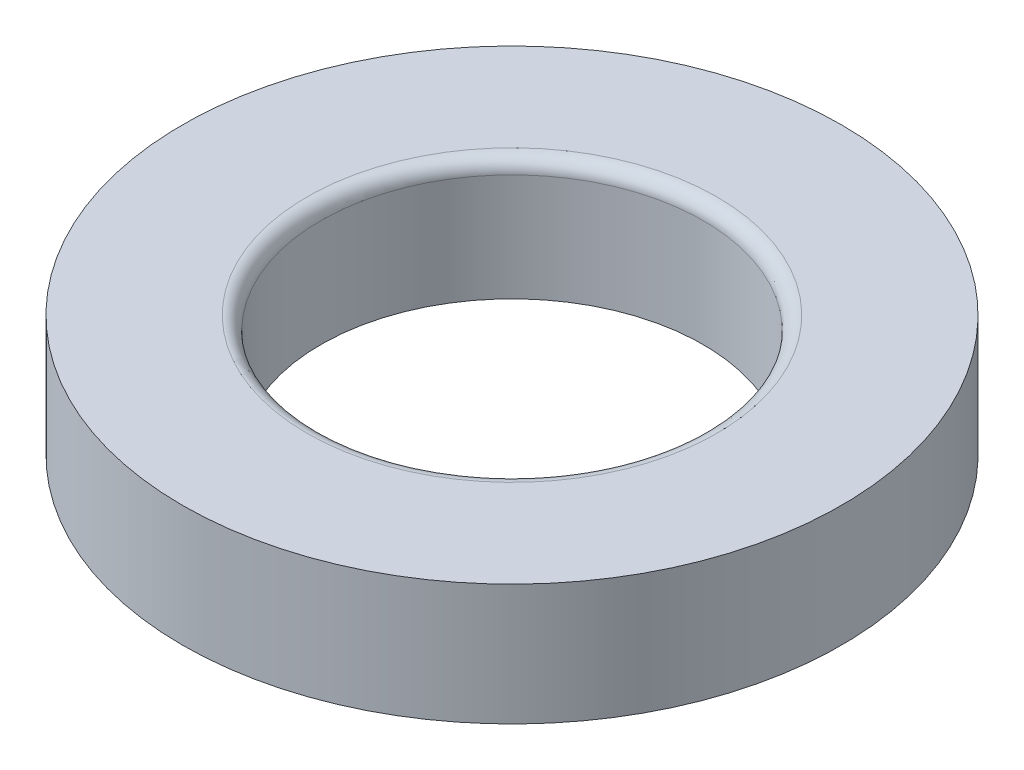
ISO-10303-21;
HEADER;
FILE_DESCRIPTION(('STEP AP214'),'2;1');
FILE_NAME('part.step','',(''),(''),'','','');
FILE_SCHEMA(('AUTOMOTIVE_DESIGN { 1 0 10303 214 1 1 1 1 }'));
ENDSEC;
DATA;
#1=APPLICATION_CONTEXT('core data for automotive mechanical design processes');
#2=APPLICATION_PROTOCOL_DEFINITION('international standard','automotive_design',2000,#1);
#3=PRODUCT_CONTEXT('',#1,'mechanical');
#4=PRODUCT('Part','Part','',(#3));
#5=PRODUCT_RELATED_PRODUCT_CATEGORY('part','',(#4));
#6=PRODUCT_DEFINITION_FORMATION('','',#4);
#7=PRODUCT_DEFINITION_CONTEXT('part definition',#1,'design');
#8=PRODUCT_DEFINITION('design','',#6,#7);
#9=PRODUCT_DEFINITION_SHAPE('','',#8);
#10=(LENGTH_UNIT() NAMED_UNIT(*) SI_UNIT(.MILLI.,.METRE.));
#11=(NAMED_UNIT(*) PLANE_ANGLE_UNIT() SI_UNIT($,.RADIAN.));
#12=(NAMED_UNIT(*) SI_UNIT($,.STERADIAN.) SOLID_ANGLE_UNIT());
#13=UNCERTAINTY_MEASURE_WITH_UNIT(LENGTH_MEASURE(1.E-05),#10,'distance_accuracy_value','');
#14=(GEOMETRIC_REPRESENTATION_CONTEXT(3) GLOBAL_UNCERTAINTY_ASSIGNED_CONTEXT((#13)) GLOBAL_UNIT_ASSIGNED_CONTEXT((#10,
#11,#12)) REPRESENTATION_CONTEXT('',''));
#15=CARTESIAN_POINT('',(0.,0.,0.));
#16=DIRECTION('',(0.,0.,1.));
#17=DIRECTION('',(1.,0.,0.));
#18=AXIS2_PLACEMENT_3D('',#15,#16,#17);
#19=CARTESIAN_POINT('',(0.,3.5000057,0.));
#20=DIRECTION('',(0.,1.,0.));
#21=DIRECTION('',(0.,0.,1.));
#22=AXIS2_PLACEMENT_3D('',#19,#20,#21);
#23=PLANE('',#22);
#24=CARTESIAN_POINT('',(0.,3.5000057,0.));
#25=DIRECTION('',(0.,1.,0.));
#26=DIRECTION('',(0.,0.,1.));
#27=AXIS2_PLACEMENT_3D('',#24,#25,#26);
#28=CIRCLE('',#27,11.84375);
#29=CARTESIAN_POINT('',(0.,3.5000057,11.84375));
#30=VERTEX_POINT('',#29);
#31=EDGE_CURVE('E10',#30,#30,#28,.F.);
#32=ORIENTED_EDGE('',*,*,#31,.T.);
#33=EDGE_LOOP('',(#32));
#34=FACE_BOUND('',#33,.T.);
#35=CARTESIAN_POINT('',(0.,3.5000057,0.));
#36=DIRECTION('',(0.,1.,0.));
#37=DIRECTION('',(0.,0.,1.));
#38=AXIS2_PLACEMENT_3D('',#35,#36,#37);
#39=CIRCLE('',#38,19.05);
#40=CARTESIAN_POINT('',(0.,3.5000057,19.05));
#41=VERTEX_POINT('',#40);
#42=EDGE_CURVE('E44',#41,#41,#39,.T.);
#43=ORIENTED_EDGE('',*,*,#42,.T.);
#44=EDGE_LOOP('',(#43));
#45=FACE_BOUND('',#44,.T.);
#46=ADVANCED_FACE('F33',(#34,#45),#23,.T.);
#47=CARTESIAN_POINT('',(0.,-3.5000057,0.));
#48=DIRECTION('',(0.,1.,0.));
#49=DIRECTION('',(0.,0.,1.));
#50=AXIS2_PLACEMENT_3D('',#47,#48,#49);
#51=PLANE('',#50);
#52=CARTESIAN_POINT('',(0.,-3.5000057,0.));
#53=DIRECTION('',(0.,1.,0.));
#54=DIRECTION('',(0.,0.,1.));
#55=AXIS2_PLACEMENT_3D('',#52,#53,#54);
#56=CIRCLE('',#55,19.05);
#57=CARTESIAN_POINT('',(0.,-3.5000057,19.05));
#58=VERTEX_POINT('',#57);
#59=EDGE_CURVE('E48',#58,#58,#56,.T.);
#60=ORIENTED_EDGE('',*,*,#59,.F.);
#61=EDGE_LOOP('',(#60));
#62=FACE_BOUND('',#61,.T.);
#63=CARTESIAN_POINT('',(0.,-3.5000057,0.));
#64=DIRECTION('',(0.,1.,0.));
#65=DIRECTION('',(0.,0.,1.));
#66=AXIS2_PLACEMENT_3D('',#63,#64,#65);
#67=CIRCLE('',#66,11.05);
#68=CARTESIAN_POINT('',(0.,-3.5000057,11.05));
#69=VERTEX_POINT('',#68);
#70=EDGE_CURVE('E52',#69,#69,#67,.T.);
#71=ORIENTED_EDGE('',*,*,#70,.T.);
#72=EDGE_LOOP('',(#71));
#73=FACE_BOUND('',#72,.T.);
#74=ADVANCED_FACE('F57',(#62,#73),#51,.F.);
#75=CARTESIAN_POINT('',(0.,3.5000057,0.));
#76=DIRECTION('',(0.,-1.,0.));
#77=DIRECTION('',(0.,0.,-1.));
#78=AXIS2_PLACEMENT_3D('',#75,#76,#77);
#79=CYLINDRICAL_SURFACE('',#78,19.05);
#80=ORIENTED_EDGE('',*,*,#42,.F.);
#81=EDGE_LOOP('',(#80));
#82=FACE_BOUND('',#81,.T.);
#83=ORIENTED_EDGE('',*,*,#59,.T.);
#84=EDGE_LOOP('',(#83));
#85=FACE_BOUND('',#84,.T.);
#86=ADVANCED_FACE('F61',(#82,#85),#79,.T.);
#87=CARTESIAN_POINT('',(0.,3.5000057,0.));
#88=DIRECTION('',(0.,-1.,0.));
#89=DIRECTION('',(0.,0.,-1.));
#90=AXIS2_PLACEMENT_3D('',#87,#88,#89);
#91=CYLINDRICAL_SURFACE('',#90,11.05);
#92=CARTESIAN_POINT('',(0.,2.7062557,0.));
#93=DIRECTION('',(0.,1.,0.));
#94=DIRECTION('',(0.,0.,1.));
#95=AXIS2_PLACEMENT_3D('',#92,#93,#94);
#96=CIRCLE('',#95,11.05);
#97=CARTESIAN_POINT('',(0.,2.7062557,11.05));
#98=VERTEX_POINT('',#97);
#99=EDGE_CURVE('E40',#98,#98,#96,.T.);
#100=ORIENTED_EDGE('',*,*,#99,.T.);
#101=EDGE_LOOP('',(#100));
#102=FACE_BOUND('',#101,.T.);
#103=ORIENTED_EDGE('',*,*,#70,.F.);
#104=EDGE_LOOP('',(#103));
#105=FACE_BOUND('',#104,.T.);
#106=ADVANCED_FACE('F59',(#102,#105),#91,.F.);
#107=CARTESIAN_POINT('',(0.,2.7062557,0.));
#108=DIRECTION('',(0.,1.,0.));
#109=DIRECTION('',(0.,0.,1.));
#110=AXIS2_PLACEMENT_3D('',#107,#108,#109);
#111=TOROIDAL_SURFACE('',#110,11.84375,0.79375);
#112=ORIENTED_EDGE('',*,*,#31,.F.);
#113=EDGE_LOOP('',(#112));
#114=FACE_BOUND('',#113,.T.);
#115=ORIENTED_EDGE('',*,*,#99,.F.);
#116=EDGE_LOOP('',(#115));
#117=FACE_BOUND('',#116,.T.);
#118=ADVANCED_FACE('F35',(#114,#117),#111,.T.);
#119=CLOSED_SHELL('',(#46,#74,#86,#106,#118));
#120=MANIFOLD_SOLID_BREP('B2',#119);
#121=ADVANCED_BREP_SHAPE_REPRESENTATION('',(#18,#120),#14);
#122=SHAPE_DEFINITION_REPRESENTATION(#9,#121);
ENDSEC;
END-ISO-10303-21;
